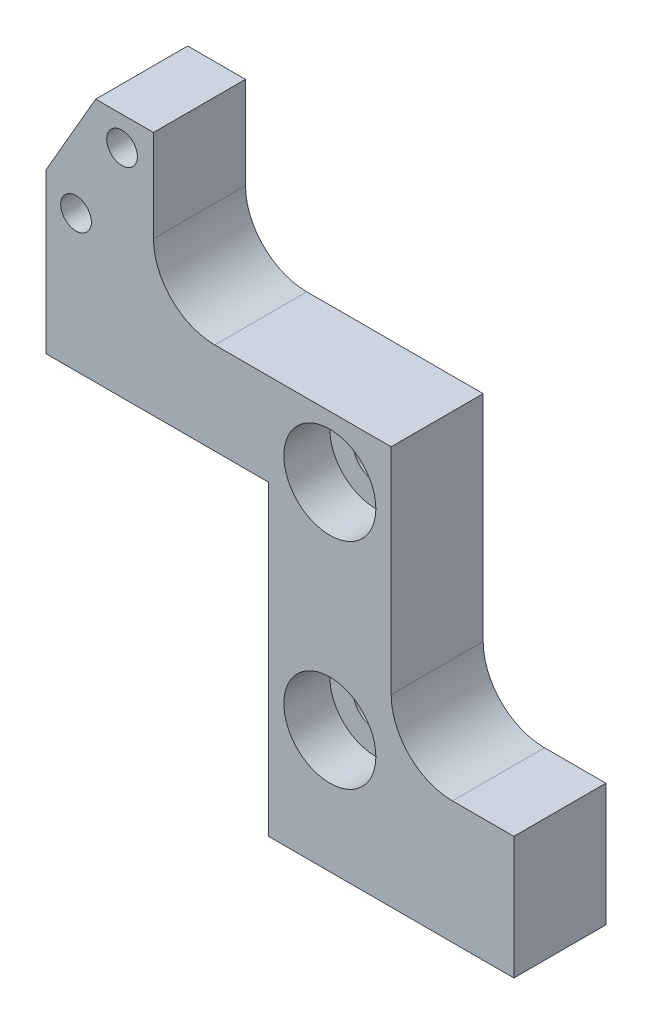
ISO-10303-21;
HEADER;
FILE_DESCRIPTION(('STEP AP214'),'2;1');
FILE_NAME('part.step','',(''),(''),'','','');
FILE_SCHEMA(('AUTOMOTIVE_DESIGN { 1 0 10303 214 1 1 1 1 }'));
ENDSEC;
DATA;
#1=APPLICATION_CONTEXT('core data for automotive mechanical design processes');
#2=APPLICATION_PROTOCOL_DEFINITION('international standard','automotive_design',2000,#1);
#3=PRODUCT_CONTEXT('',#1,'mechanical');
#4=PRODUCT('Part','Part','',(#3));
#5=PRODUCT_RELATED_PRODUCT_CATEGORY('part','',(#4));
#6=PRODUCT_DEFINITION_FORMATION('','',#4);
#7=PRODUCT_DEFINITION_CONTEXT('part definition',#1,'design');
#8=PRODUCT_DEFINITION('design','',#6,#7);
#9=PRODUCT_DEFINITION_SHAPE('','',#8);
#10=(LENGTH_UNIT() NAMED_UNIT(*) SI_UNIT(.MILLI.,.METRE.));
#11=(NAMED_UNIT(*) PLANE_ANGLE_UNIT() SI_UNIT($,.RADIAN.));
#12=(NAMED_UNIT(*) SI_UNIT($,.STERADIAN.) SOLID_ANGLE_UNIT());
#13=UNCERTAINTY_MEASURE_WITH_UNIT(LENGTH_MEASURE(1.E-05),#10,'distance_accuracy_value','');
#14=(GEOMETRIC_REPRESENTATION_CONTEXT(3) GLOBAL_UNCERTAINTY_ASSIGNED_CONTEXT((#13)) GLOBAL_UNIT_ASSIGNED_CONTEXT((#10,
#11,#12)) REPRESENTATION_CONTEXT('',''));
#15=CARTESIAN_POINT('',(0.,0.,0.));
#16=DIRECTION('',(0.,0.,1.));
#17=DIRECTION('',(1.,0.,0.));
#18=AXIS2_PLACEMENT_3D('',#15,#16,#17);
#19=CARTESIAN_POINT('',(0.,0.,6.));
#20=DIRECTION('',(0.,0.,1.));
#21=DIRECTION('',(1.,0.,0.));
#22=AXIS2_PLACEMENT_3D('',#19,#20,#21);
#23=PLANE('',#22);
#24=CARTESIAN_POINT('',(-12.,8.,6.));
#25=DIRECTION('',(0.,0.,1.));
#26=DIRECTION('',(1.,0.,0.));
#27=AXIS2_PLACEMENT_3D('',#24,#25,#26);
#28=CIRCLE('',#27,3.);
#29=CARTESIAN_POINT('',(-9.,8.,6.));
#30=VERTEX_POINT('',#29);
#31=EDGE_CURVE('E180',#30,#30,#28,.T.);
#32=ORIENTED_EDGE('',*,*,#31,.F.);
#33=EDGE_LOOP('',(#32));
#34=FACE_BOUND('',#33,.T.);
#35=CARTESIAN_POINT('',(-12.,22.,6.));
#36=DIRECTION('',(0.,0.,1.));
#37=DIRECTION('',(1.,0.,0.));
#38=AXIS2_PLACEMENT_3D('',#35,#36,#37);
#39=CIRCLE('',#38,3.);
#40=CARTESIAN_POINT('',(-9.,22.,6.));
#41=VERTEX_POINT('',#40);
#42=EDGE_CURVE('E186',#41,#41,#39,.T.);
#43=ORIENTED_EDGE('',*,*,#42,.F.);
#44=EDGE_LOOP('',(#43));
#45=FACE_BOUND('',#44,.T.);
#46=CARTESIAN_POINT('',(-28.55,28.91,6.));
#47=DIRECTION('',(0.,0.,1.));
#48=DIRECTION('',(1.,0.,0.));
#49=AXIS2_PLACEMENT_3D('',#46,#47,#48);
#50=CIRCLE('',#49,1.);
#51=CARTESIAN_POINT('',(-27.55,28.91,6.));
#52=VERTEX_POINT('',#51);
#53=EDGE_CURVE('E201',#52,#52,#50,.T.);
#54=ORIENTED_EDGE('',*,*,#53,.F.);
#55=EDGE_LOOP('',(#54));
#56=FACE_BOUND('',#55,.T.);
#57=DIRECTION('',(0.,1.,0.));
#58=VECTOR('',#57,1.);
#59=CARTESIAN_POINT('',(0.,0.,6.));
#60=LINE('',#59,#58);
#61=CARTESIAN_POINT('',(0.,0.,6.));
#62=VERTEX_POINT('',#61);
#63=CARTESIAN_POINT('',(0.,8.,6.));
#64=VERTEX_POINT('',#63);
#65=EDGE_CURVE('E207',#62,#64,#60,.T.);
#66=ORIENTED_EDGE('',*,*,#65,.T.);
#67=DIRECTION('',(-1.,0.,0.));
#68=VECTOR('',#67,1.);
#69=CARTESIAN_POINT('',(0.,8.,6.));
#70=LINE('',#69,#68);
#71=CARTESIAN_POINT('',(-4.,8.,6.));
#72=VERTEX_POINT('',#71);
#73=EDGE_CURVE('E210',#64,#72,#70,.T.);
#74=ORIENTED_EDGE('',*,*,#73,.T.);
#75=CARTESIAN_POINT('',(-4.,12.,6.));
#76=DIRECTION('',(0.,0.,1.));
#77=DIRECTION('',(1.,0.,0.));
#78=AXIS2_PLACEMENT_3D('',#75,#76,#77);
#79=CIRCLE('',#78,4.);
#80=CARTESIAN_POINT('',(-8.,12.,6.));
#81=VERTEX_POINT('',#80);
#82=EDGE_CURVE('E11',#72,#81,#79,.F.);
#83=ORIENTED_EDGE('',*,*,#82,.T.);
#84=DIRECTION('',(0.,1.,0.));
#85=VECTOR('',#84,1.);
#86=CARTESIAN_POINT('',(-8.,8.,6.));
#87=LINE('',#86,#85);
#88=CARTESIAN_POINT('',(-8.,26.,6.));
#89=VERTEX_POINT('',#88);
#90=EDGE_CURVE('E213',#81,#89,#87,.T.);
#91=ORIENTED_EDGE('',*,*,#90,.T.);
#92=DIRECTION('',(-1.,0.,0.));
#93=VECTOR('',#92,1.);
#94=CARTESIAN_POINT('',(-16.,26.,6.));
#95=LINE('',#94,#93);
#96=CARTESIAN_POINT('',(-19.5,26.,6.));
#97=VERTEX_POINT('',#96);
#98=EDGE_CURVE('E215',#89,#97,#95,.T.);
#99=ORIENTED_EDGE('',*,*,#98,.T.);
#100=CARTESIAN_POINT('',(-19.5,30.,6.));
#101=DIRECTION('',(0.,0.,1.));
#102=DIRECTION('',(1.,0.,0.));
#103=AXIS2_PLACEMENT_3D('',#100,#101,#102);
#104=CIRCLE('',#103,4.);
#105=CARTESIAN_POINT('',(-23.5,30.,6.));
#106=VERTEX_POINT('',#105);
#107=EDGE_CURVE('E290',#97,#106,#104,.F.);
#108=ORIENTED_EDGE('',*,*,#107,.T.);
#109=DIRECTION('',(0.,1.,0.));
#110=VECTOR('',#109,1.);
#111=CARTESIAN_POINT('',(-23.5,26.,6.));
#112=LINE('',#111,#110);
#113=CARTESIAN_POINT('',(-23.5,36.,6.));
#114=VERTEX_POINT('',#113);
#115=EDGE_CURVE('E218',#106,#114,#112,.T.);
#116=ORIENTED_EDGE('',*,*,#115,.T.);
#117=DIRECTION('',(-1.,0.,0.));
#118=VECTOR('',#117,1.);
#119=CARTESIAN_POINT('',(-27.2668384925381,36.,6.));
#120=LINE('',#119,#118);
#121=CARTESIAN_POINT('',(-27.2668384925381,36.,6.));
#122=VERTEX_POINT('',#121);
#123=EDGE_CURVE('E220',#114,#122,#120,.T.);
#124=ORIENTED_EDGE('',*,*,#123,.T.);
#125=DIRECTION('',(-0.499999999999995,-0.866025403784442,0.));
#126=VECTOR('',#125,1.);
#127=CARTESIAN_POINT('',(-27.2668384925381,36.,6.));
#128=LINE('',#127,#126);
#129=CARTESIAN_POINT('',(-30.5,30.4,6.));
#130=VERTEX_POINT('',#129);
#131=EDGE_CURVE('E222',#122,#130,#128,.T.);
#132=ORIENTED_EDGE('',*,*,#131,.T.);
#133=DIRECTION('',(0.,-1.,0.));
#134=VECTOR('',#133,1.);
#135=CARTESIAN_POINT('',(-30.5,26.,6.));
#136=LINE('',#135,#134);
#137=CARTESIAN_POINT('',(-30.5,20.,6.));
#138=VERTEX_POINT('',#137);
#139=EDGE_CURVE('E224',#130,#138,#136,.T.);
#140=ORIENTED_EDGE('',*,*,#139,.T.);
#141=DIRECTION('',(1.,0.,0.));
#142=VECTOR('',#141,1.);
#143=CARTESIAN_POINT('',(-16.,20.,6.));
#144=LINE('',#143,#142);
#145=CARTESIAN_POINT('',(-16.,20.,6.));
#146=VERTEX_POINT('',#145);
#147=EDGE_CURVE('E226',#138,#146,#144,.T.);
#148=ORIENTED_EDGE('',*,*,#147,.T.);
#149=DIRECTION('',(0.,-1.,0.));
#150=VECTOR('',#149,1.);
#151=CARTESIAN_POINT('',(-16.,8.,6.));
#152=LINE('',#151,#150);
#153=CARTESIAN_POINT('',(-16.,0.,6.));
#154=VERTEX_POINT('',#153);
#155=EDGE_CURVE('E228',#146,#154,#152,.T.);
#156=ORIENTED_EDGE('',*,*,#155,.T.);
#157=DIRECTION('',(1.,0.,0.));
#158=VECTOR('',#157,1.);
#159=CARTESIAN_POINT('',(0.,0.,6.));
#160=LINE('',#159,#158);
#161=EDGE_CURVE('E230',#154,#62,#160,.T.);
#162=ORIENTED_EDGE('',*,*,#161,.T.);
#163=EDGE_LOOP('',(#66,#74,#83,#91,#99,#108,#116,#124,#132,#140,#148,#156,#162));
#164=FACE_BOUND('',#163,.T.);
#165=CARTESIAN_POINT('',(-25.55,34.1061524227066,6.));
#166=DIRECTION('',(0.,0.,1.));
#167=DIRECTION('',(1.,0.,0.));
#168=AXIS2_PLACEMENT_3D('',#165,#166,#167);
#169=CIRCLE('',#168,1.);
#170=CARTESIAN_POINT('',(-24.55,34.1061524227066,6.));
#171=VERTEX_POINT('',#170);
#172=EDGE_CURVE('E195',#171,#171,#169,.T.);
#173=ORIENTED_EDGE('',*,*,#172,.F.);
#174=EDGE_LOOP('',(#173));
#175=FACE_BOUND('',#174,.T.);
#176=ADVANCED_FACE('F37',(#34,#45,#56,#164,#175),#23,.T.);
#177=CARTESIAN_POINT('',(0.,0.,0.));
#178=DIRECTION('',(0.,0.,1.));
#179=DIRECTION('',(1.,0.,0.));
#180=AXIS2_PLACEMENT_3D('',#177,#178,#179);
#181=PLANE('',#180);
#182=CARTESIAN_POINT('',(-12.,8.,0.));
#183=DIRECTION('',(0.,0.,1.));
#184=DIRECTION('',(1.,0.,0.));
#185=AXIS2_PLACEMENT_3D('',#182,#183,#184);
#186=CIRCLE('',#185,1.5);
#187=CARTESIAN_POINT('',(-10.5,8.,0.));
#188=VERTEX_POINT('',#187);
#189=EDGE_CURVE('E171',#188,#188,#186,.T.);
#190=ORIENTED_EDGE('',*,*,#189,.T.);
#191=EDGE_LOOP('',(#190));
#192=FACE_BOUND('',#191,.T.);
#193=CARTESIAN_POINT('',(-12.,22.,0.));
#194=DIRECTION('',(0.,0.,1.));
#195=DIRECTION('',(1.,0.,0.));
#196=AXIS2_PLACEMENT_3D('',#193,#194,#195);
#197=CIRCLE('',#196,1.5);
#198=CARTESIAN_POINT('',(-10.5,22.,0.));
#199=VERTEX_POINT('',#198);
#200=EDGE_CURVE('E177',#199,#199,#197,.T.);
#201=ORIENTED_EDGE('',*,*,#200,.T.);
#202=EDGE_LOOP('',(#201));
#203=FACE_BOUND('',#202,.T.);
#204=CARTESIAN_POINT('',(-28.55,28.91,0.));
#205=DIRECTION('',(0.,0.,1.));
#206=DIRECTION('',(1.,0.,0.));
#207=AXIS2_PLACEMENT_3D('',#204,#205,#206);
#208=CIRCLE('',#207,1.);
#209=CARTESIAN_POINT('',(-27.55,28.91,0.));
#210=VERTEX_POINT('',#209);
#211=EDGE_CURVE('E198',#210,#210,#208,.T.);
#212=ORIENTED_EDGE('',*,*,#211,.T.);
#213=EDGE_LOOP('',(#212));
#214=FACE_BOUND('',#213,.T.);
#215=DIRECTION('',(0.,1.,0.));
#216=VECTOR('',#215,1.);
#217=CARTESIAN_POINT('',(0.,0.,0.));
#218=LINE('',#217,#216);
#219=CARTESIAN_POINT('',(0.,0.,0.));
#220=VERTEX_POINT('',#219);
#221=CARTESIAN_POINT('',(0.,8.,0.));
#222=VERTEX_POINT('',#221);
#223=EDGE_CURVE('E204',#220,#222,#218,.T.);
#224=ORIENTED_EDGE('',*,*,#223,.F.);
#225=DIRECTION('',(1.,0.,0.));
#226=VECTOR('',#225,1.);
#227=CARTESIAN_POINT('',(0.,0.,0.));
#228=LINE('',#227,#226);
#229=CARTESIAN_POINT('',(-16.,0.,0.));
#230=VERTEX_POINT('',#229);
#231=EDGE_CURVE('E211',#230,#220,#228,.T.);
#232=ORIENTED_EDGE('',*,*,#231,.F.);
#233=DIRECTION('',(0.,-1.,0.));
#234=VECTOR('',#233,1.);
#235=CARTESIAN_POINT('',(-16.,0.,0.));
#236=LINE('',#235,#234);
#237=CARTESIAN_POINT('',(-16.,20.,0.));
#238=VERTEX_POINT('',#237);
#239=EDGE_CURVE('E254',#238,#230,#236,.T.);
#240=ORIENTED_EDGE('',*,*,#239,.F.);
#241=DIRECTION('',(1.,0.,0.));
#242=VECTOR('',#241,1.);
#243=CARTESIAN_POINT('',(-16.,20.,0.));
#244=LINE('',#243,#242);
#245=CARTESIAN_POINT('',(-30.5,20.,0.));
#246=VERTEX_POINT('',#245);
#247=EDGE_CURVE('E251',#246,#238,#244,.T.);
#248=ORIENTED_EDGE('',*,*,#247,.F.);
#249=DIRECTION('',(0.,-1.,0.));
#250=VECTOR('',#249,1.);
#251=CARTESIAN_POINT('',(-30.5,26.,0.));
#252=LINE('',#251,#250);
#253=CARTESIAN_POINT('',(-30.5,30.4,0.));
#254=VERTEX_POINT('',#253);
#255=EDGE_CURVE('E249',#254,#246,#252,.T.);
#256=ORIENTED_EDGE('',*,*,#255,.F.);
#257=DIRECTION('',(-0.499999999999995,-0.866025403784442,0.));
#258=VECTOR('',#257,1.);
#259=CARTESIAN_POINT('',(-27.2668384925381,36.,0.));
#260=LINE('',#259,#258);
#261=CARTESIAN_POINT('',(-27.2668384925381,36.,0.));
#262=VERTEX_POINT('',#261);
#263=EDGE_CURVE('E246',#262,#254,#260,.T.);
#264=ORIENTED_EDGE('',*,*,#263,.F.);
#265=DIRECTION('',(-1.,0.,0.));
#266=VECTOR('',#265,1.);
#267=CARTESIAN_POINT('',(-27.2668384925381,36.,0.));
#268=LINE('',#267,#266);
#269=CARTESIAN_POINT('',(-23.5,36.,0.));
#270=VERTEX_POINT('',#269);
#271=EDGE_CURVE('E244',#270,#262,#268,.T.);
#272=ORIENTED_EDGE('',*,*,#271,.F.);
#273=DIRECTION('',(0.,1.,0.));
#274=VECTOR('',#273,1.);
#275=CARTESIAN_POINT('',(-23.5,26.,0.));
#276=LINE('',#275,#274);
#277=CARTESIAN_POINT('',(-23.5,30.,0.));
#278=VERTEX_POINT('',#277);
#279=EDGE_CURVE('E242',#278,#270,#276,.T.);
#280=ORIENTED_EDGE('',*,*,#279,.F.);
#281=CARTESIAN_POINT('',(-19.5,30.,0.));
#282=DIRECTION('',(0.,0.,1.));
#283=DIRECTION('',(1.,0.,0.));
#284=AXIS2_PLACEMENT_3D('',#281,#282,#283);
#285=CIRCLE('',#284,4.);
#286=CARTESIAN_POINT('',(-19.5,26.,0.));
#287=VERTEX_POINT('',#286);
#288=EDGE_CURVE('E288',#278,#287,#285,.T.);
#289=ORIENTED_EDGE('',*,*,#288,.T.);
#290=DIRECTION('',(-1.,0.,0.));
#291=VECTOR('',#290,1.);
#292=CARTESIAN_POINT('',(-16.,26.,0.));
#293=LINE('',#292,#291);
#294=CARTESIAN_POINT('',(-8.,26.,0.));
#295=VERTEX_POINT('',#294);
#296=EDGE_CURVE('E239',#295,#287,#293,.T.);
#297=ORIENTED_EDGE('',*,*,#296,.F.);
#298=DIRECTION('',(0.,1.,0.));
#299=VECTOR('',#298,1.);
#300=CARTESIAN_POINT('',(-8.,8.,0.));
#301=LINE('',#300,#299);
#302=CARTESIAN_POINT('',(-8.,12.,0.));
#303=VERTEX_POINT('',#302);
#304=EDGE_CURVE('E237',#303,#295,#301,.T.);
#305=ORIENTED_EDGE('',*,*,#304,.F.);
#306=CARTESIAN_POINT('',(-4.,12.,0.));
#307=DIRECTION('',(0.,0.,1.));
#308=DIRECTION('',(1.,0.,0.));
#309=AXIS2_PLACEMENT_3D('',#306,#307,#308);
#310=CIRCLE('',#309,4.);
#311=CARTESIAN_POINT('',(-4.,8.,0.));
#312=VERTEX_POINT('',#311);
#313=EDGE_CURVE('E45',#303,#312,#310,.T.);
#314=ORIENTED_EDGE('',*,*,#313,.T.);
#315=DIRECTION('',(-1.,0.,0.));
#316=VECTOR('',#315,1.);
#317=CARTESIAN_POINT('',(0.,8.,0.));
#318=LINE('',#317,#316);
#319=EDGE_CURVE('E235',#222,#312,#318,.T.);
#320=ORIENTED_EDGE('',*,*,#319,.F.);
#321=EDGE_LOOP('',(#224,#232,#240,#248,#256,#264,#272,#280,#289,#297,#305,#314,#320));
#322=FACE_BOUND('',#321,.T.);
#323=CARTESIAN_POINT('',(-25.55,34.1061524227066,0.));
#324=DIRECTION('',(0.,0.,1.));
#325=DIRECTION('',(1.,0.,0.));
#326=AXIS2_PLACEMENT_3D('',#323,#324,#325);
#327=CIRCLE('',#326,1.);
#328=CARTESIAN_POINT('',(-24.55,34.1061524227066,0.));
#329=VERTEX_POINT('',#328);
#330=EDGE_CURVE('E192',#329,#329,#327,.T.);
#331=ORIENTED_EDGE('',*,*,#330,.T.);
#332=EDGE_LOOP('',(#331));
#333=FACE_BOUND('',#332,.T.);
#334=ADVANCED_FACE('F304',(#192,#203,#214,#322,#333),#181,.F.);
#335=CARTESIAN_POINT('',(0.,0.,6.));
#336=DIRECTION('',(-1.,0.,0.));
#337=DIRECTION('',(0.,-1.,0.));
#338=AXIS2_PLACEMENT_3D('',#335,#336,#337);
#339=PLANE('',#338);
#340=ORIENTED_EDGE('',*,*,#223,.T.);
#341=DIRECTION('',(0.,0.,-1.));
#342=VECTOR('',#341,1.);
#343=CARTESIAN_POINT('',(0.,8.,6.));
#344=LINE('',#343,#342);
#345=EDGE_CURVE('E280',#64,#222,#344,.T.);
#346=ORIENTED_EDGE('',*,*,#345,.F.);
#347=ORIENTED_EDGE('',*,*,#65,.F.);
#348=DIRECTION('',(0.,0.,-1.));
#349=VECTOR('',#348,1.);
#350=CARTESIAN_POINT('',(0.,0.,6.));
#351=LINE('',#350,#349);
#352=EDGE_CURVE('E232',#62,#220,#351,.T.);
#353=ORIENTED_EDGE('',*,*,#352,.T.);
#354=EDGE_LOOP('',(#340,#346,#347,#353));
#355=FACE_BOUND('',#354,.T.);
#356=ADVANCED_FACE('F352',(#355),#339,.F.);
#357=CARTESIAN_POINT('',(0.,8.,6.));
#358=DIRECTION('',(0.,-1.,0.));
#359=DIRECTION('',(1.,0.,0.));
#360=AXIS2_PLACEMENT_3D('',#357,#358,#359);
#361=PLANE('',#360);
#362=ORIENTED_EDGE('',*,*,#319,.T.);
#363=DIRECTION('',(0.,0.,-1.));
#364=VECTOR('',#363,1.);
#365=CARTESIAN_POINT('',(-4.,8.,6.));
#366=LINE('',#365,#364);
#367=EDGE_CURVE('E52',#312,#72,#366,.F.);
#368=ORIENTED_EDGE('',*,*,#367,.T.);
#369=ORIENTED_EDGE('',*,*,#73,.F.);
#370=ORIENTED_EDGE('',*,*,#345,.T.);
#371=EDGE_LOOP('',(#362,#368,#369,#370));
#372=FACE_BOUND('',#371,.T.);
#373=ADVANCED_FACE('F353',(#372),#361,.F.);
#374=CARTESIAN_POINT('',(-8.,8.,6.));
#375=DIRECTION('',(-1.,0.,0.));
#376=DIRECTION('',(0.,0.,1.));
#377=AXIS2_PLACEMENT_3D('',#374,#375,#376);
#378=PLANE('',#377);
#379=ORIENTED_EDGE('',*,*,#90,.F.);
#380=DIRECTION('',(0.,0.,-1.));
#381=VECTOR('',#380,1.);
#382=CARTESIAN_POINT('',(-8.,12.,0.));
#383=LINE('',#382,#381);
#384=EDGE_CURVE('E292',#81,#303,#383,.T.);
#385=ORIENTED_EDGE('',*,*,#384,.T.);
#386=ORIENTED_EDGE('',*,*,#304,.T.);
#387=DIRECTION('',(0.,0.,-1.));
#388=VECTOR('',#387,1.);
#389=CARTESIAN_POINT('',(-8.,26.,6.));
#390=LINE('',#389,#388);
#391=EDGE_CURVE('E277',#89,#295,#390,.T.);
#392=ORIENTED_EDGE('',*,*,#391,.F.);
#393=EDGE_LOOP('',(#379,#385,#386,#392));
#394=FACE_BOUND('',#393,.T.);
#395=ADVANCED_FACE('F298',(#394),#378,.F.);
#396=CARTESIAN_POINT('',(-16.,26.,6.));
#397=DIRECTION('',(0.,-1.,0.));
#398=DIRECTION('',(1.,0.,0.));
#399=AXIS2_PLACEMENT_3D('',#396,#397,#398);
#400=PLANE('',#399);
#401=ORIENTED_EDGE('',*,*,#296,.T.);
#402=DIRECTION('',(0.,0.,-1.));
#403=VECTOR('',#402,1.);
#404=CARTESIAN_POINT('',(-19.5,26.,6.));
#405=LINE('',#404,#403);
#406=EDGE_CURVE('E286',#287,#97,#405,.F.);
#407=ORIENTED_EDGE('',*,*,#406,.T.);
#408=ORIENTED_EDGE('',*,*,#98,.F.);
#409=ORIENTED_EDGE('',*,*,#391,.T.);
#410=EDGE_LOOP('',(#401,#407,#408,#409));
#411=FACE_BOUND('',#410,.T.);
#412=ADVANCED_FACE('F310',(#411),#400,.F.);
#413=CARTESIAN_POINT('',(-23.5,26.,6.));
#414=DIRECTION('',(-1.,0.,0.));
#415=DIRECTION('',(0.,0.,1.));
#416=AXIS2_PLACEMENT_3D('',#413,#414,#415);
#417=PLANE('',#416);
#418=ORIENTED_EDGE('',*,*,#115,.F.);
#419=DIRECTION('',(0.,0.,-1.));
#420=VECTOR('',#419,1.);
#421=CARTESIAN_POINT('',(-23.5,30.,0.));
#422=LINE('',#421,#420);
#423=EDGE_CURVE('E283',#106,#278,#422,.T.);
#424=ORIENTED_EDGE('',*,*,#423,.T.);
#425=ORIENTED_EDGE('',*,*,#279,.T.);
#426=DIRECTION('',(0.,0.,-1.));
#427=VECTOR('',#426,1.);
#428=CARTESIAN_POINT('',(-23.5,36.,6.));
#429=LINE('',#428,#427);
#430=EDGE_CURVE('E274',#114,#270,#429,.T.);
#431=ORIENTED_EDGE('',*,*,#430,.F.);
#432=EDGE_LOOP('',(#418,#424,#425,#431));
#433=FACE_BOUND('',#432,.T.);
#434=ADVANCED_FACE('F319',(#433),#417,.F.);
#435=CARTESIAN_POINT('',(-27.2668384925381,36.,6.));
#436=DIRECTION('',(0.,-1.,0.));
#437=DIRECTION('',(0.,0.,-1.));
#438=AXIS2_PLACEMENT_3D('',#435,#436,#437);
#439=PLANE('',#438);
#440=ORIENTED_EDGE('',*,*,#271,.T.);
#441=DIRECTION('',(0.,0.,-1.));
#442=VECTOR('',#441,1.);
#443=CARTESIAN_POINT('',(-27.2668384925381,36.,6.));
#444=LINE('',#443,#442);
#445=EDGE_CURVE('E271',#122,#262,#444,.T.);
#446=ORIENTED_EDGE('',*,*,#445,.F.);
#447=ORIENTED_EDGE('',*,*,#123,.F.);
#448=ORIENTED_EDGE('',*,*,#430,.T.);
#449=EDGE_LOOP('',(#440,#446,#447,#448));
#450=FACE_BOUND('',#449,.T.);
#451=ADVANCED_FACE('F325',(#450),#439,.F.);
#452=CARTESIAN_POINT('',(-27.2668384925381,36.,6.));
#453=DIRECTION('',(0.866025403784442,-0.499999999999995,0.));
#454=DIRECTION('',(0.499999999999995,0.866025403784442,0.));
#455=AXIS2_PLACEMENT_3D('',#452,#453,#454);
#456=PLANE('',#455);
#457=ORIENTED_EDGE('',*,*,#263,.T.);
#458=DIRECTION('',(0.,0.,-1.));
#459=VECTOR('',#458,1.);
#460=CARTESIAN_POINT('',(-30.5,30.4,6.));
#461=LINE('',#460,#459);
#462=EDGE_CURVE('E268',#130,#254,#461,.T.);
#463=ORIENTED_EDGE('',*,*,#462,.F.);
#464=ORIENTED_EDGE('',*,*,#131,.F.);
#465=ORIENTED_EDGE('',*,*,#445,.T.);
#466=EDGE_LOOP('',(#457,#463,#464,#465));
#467=FACE_BOUND('',#466,.T.);
#468=ADVANCED_FACE('F329',(#467),#456,.F.);
#469=CARTESIAN_POINT('',(-30.5,26.,6.));
#470=DIRECTION('',(1.,0.,0.));
#471=DIRECTION('',(0.,0.,-1.));
#472=AXIS2_PLACEMENT_3D('',#469,#470,#471);
#473=PLANE('',#472);
#474=ORIENTED_EDGE('',*,*,#255,.T.);
#475=DIRECTION('',(0.,0.,-1.));
#476=VECTOR('',#475,1.);
#477=CARTESIAN_POINT('',(-30.5,20.,6.));
#478=LINE('',#477,#476);
#479=EDGE_CURVE('E265',#138,#246,#478,.T.);
#480=ORIENTED_EDGE('',*,*,#479,.F.);
#481=ORIENTED_EDGE('',*,*,#139,.F.);
#482=ORIENTED_EDGE('',*,*,#462,.T.);
#483=EDGE_LOOP('',(#474,#480,#481,#482));
#484=FACE_BOUND('',#483,.T.);
#485=ADVANCED_FACE('F336',(#484),#473,.F.);
#486=CARTESIAN_POINT('',(-16.,20.,6.));
#487=DIRECTION('',(0.,1.,0.));
#488=DIRECTION('',(-1.,0.,0.));
#489=AXIS2_PLACEMENT_3D('',#486,#487,#488);
#490=PLANE('',#489);
#491=ORIENTED_EDGE('',*,*,#247,.T.);
#492=DIRECTION('',(0.,0.,-1.));
#493=VECTOR('',#492,1.);
#494=CARTESIAN_POINT('',(-16.,20.,6.));
#495=LINE('',#494,#493);
#496=EDGE_CURVE('E262',#146,#238,#495,.T.);
#497=ORIENTED_EDGE('',*,*,#496,.F.);
#498=ORIENTED_EDGE('',*,*,#147,.F.);
#499=ORIENTED_EDGE('',*,*,#479,.T.);
#500=EDGE_LOOP('',(#491,#497,#498,#499));
#501=FACE_BOUND('',#500,.T.);
#502=ADVANCED_FACE('F339',(#501),#490,.F.);
#503=CARTESIAN_POINT('',(-16.,0.,6.));
#504=DIRECTION('',(1.,0.,0.));
#505=DIRECTION('',(0.,0.,-1.));
#506=AXIS2_PLACEMENT_3D('',#503,#504,#505);
#507=PLANE('',#506);
#508=ORIENTED_EDGE('',*,*,#239,.T.);
#509=DIRECTION('',(0.,0.,-1.));
#510=VECTOR('',#509,1.);
#511=CARTESIAN_POINT('',(-16.,0.,6.));
#512=LINE('',#511,#510);
#513=EDGE_CURVE('E259',#154,#230,#512,.T.);
#514=ORIENTED_EDGE('',*,*,#513,.F.);
#515=ORIENTED_EDGE('',*,*,#155,.F.);
#516=ORIENTED_EDGE('',*,*,#496,.T.);
#517=EDGE_LOOP('',(#508,#514,#515,#516));
#518=FACE_BOUND('',#517,.T.);
#519=ADVANCED_FACE('F343',(#518),#507,.F.);
#520=CARTESIAN_POINT('',(0.,0.,6.));
#521=DIRECTION('',(0.,1.,0.));
#522=DIRECTION('',(-1.,0.,0.));
#523=AXIS2_PLACEMENT_3D('',#520,#521,#522);
#524=PLANE('',#523);
#525=CARTESIAN_POINT('',(-8.,0.,3.));
#526=DIRECTION('',(0.,-1.,0.));
#527=DIRECTION('',(0.,0.,-1.));
#528=AXIS2_PLACEMENT_3D('',#525,#526,#527);
#529=CIRCLE('',#528,0.999999999999989);
#530=CARTESIAN_POINT('',(-8.,0.,2.00000000000001));
#531=VERTEX_POINT('',#530);
#532=EDGE_CURVE('E148',#531,#531,#529,.T.);
#533=ORIENTED_EDGE('',*,*,#532,.F.);
#534=EDGE_LOOP('',(#533));
#535=FACE_BOUND('',#534,.T.);
#536=CARTESIAN_POINT('',(-13.,0.,3.));
#537=DIRECTION('',(0.,-1.,0.));
#538=DIRECTION('',(0.,0.,-1.));
#539=AXIS2_PLACEMENT_3D('',#536,#537,#538);
#540=CIRCLE('',#539,1.525);
#541=CARTESIAN_POINT('',(-13.,0.,1.475));
#542=VERTEX_POINT('',#541);
#543=EDGE_CURVE('E147',#542,#542,#540,.T.);
#544=ORIENTED_EDGE('',*,*,#543,.F.);
#545=EDGE_LOOP('',(#544));
#546=FACE_BOUND('',#545,.T.);
#547=CARTESIAN_POINT('',(-3.,0.,3.));
#548=DIRECTION('',(0.,-1.,0.));
#549=DIRECTION('',(0.,0.,-1.));
#550=AXIS2_PLACEMENT_3D('',#547,#548,#549);
#551=CIRCLE('',#550,1.525);
#552=CARTESIAN_POINT('',(-3.,0.,1.475));
#553=VERTEX_POINT('',#552);
#554=EDGE_CURVE('E161',#553,#553,#551,.T.);
#555=ORIENTED_EDGE('',*,*,#554,.F.);
#556=EDGE_LOOP('',(#555));
#557=FACE_BOUND('',#556,.T.);
#558=ORIENTED_EDGE('',*,*,#231,.T.);
#559=ORIENTED_EDGE('',*,*,#352,.F.);
#560=ORIENTED_EDGE('',*,*,#161,.F.);
#561=ORIENTED_EDGE('',*,*,#513,.T.);
#562=EDGE_LOOP('',(#558,#559,#560,#561));
#563=FACE_BOUND('',#562,.T.);
#564=ADVANCED_FACE('F349',(#535,#546,#557,#563),#524,.F.);
#565=CARTESIAN_POINT('',(-28.55,28.91,6.));
#566=DIRECTION('',(0.,0.,-1.));
#567=DIRECTION('',(-1.,0.,0.));
#568=AXIS2_PLACEMENT_3D('',#565,#566,#567);
#569=CYLINDRICAL_SURFACE('',#568,1.);
#570=ORIENTED_EDGE('',*,*,#53,.T.);
#571=EDGE_LOOP('',(#570));
#572=FACE_BOUND('',#571,.T.);
#573=ORIENTED_EDGE('',*,*,#211,.F.);
#574=EDGE_LOOP('',(#573));
#575=FACE_BOUND('',#574,.T.);
#576=ADVANCED_FACE('F375',(#572,#575),#569,.F.);
#577=CARTESIAN_POINT('',(-25.55,34.1061524227066,6.));
#578=DIRECTION('',(0.,0.,-1.));
#579=DIRECTION('',(-1.,0.,0.));
#580=AXIS2_PLACEMENT_3D('',#577,#578,#579);
#581=CYLINDRICAL_SURFACE('',#580,1.);
#582=ORIENTED_EDGE('',*,*,#172,.T.);
#583=EDGE_LOOP('',(#582));
#584=FACE_BOUND('',#583,.T.);
#585=ORIENTED_EDGE('',*,*,#330,.F.);
#586=EDGE_LOOP('',(#585));
#587=FACE_BOUND('',#586,.T.);
#588=ADVANCED_FACE('F363',(#584,#587),#581,.F.);
#589=CARTESIAN_POINT('',(-19.5,30.,6.));
#590=DIRECTION('',(0.,0.,1.));
#591=DIRECTION('',(1.,0.,0.));
#592=AXIS2_PLACEMENT_3D('',#589,#590,#591);
#593=CYLINDRICAL_SURFACE('',#592,4.);
#594=ORIENTED_EDGE('',*,*,#107,.F.);
#595=ORIENTED_EDGE('',*,*,#406,.F.);
#596=ORIENTED_EDGE('',*,*,#288,.F.);
#597=ORIENTED_EDGE('',*,*,#423,.F.);
#598=EDGE_LOOP('',(#594,#595,#596,#597));
#599=FACE_BOUND('',#598,.T.);
#600=ADVANCED_FACE('F317',(#599),#593,.F.);
#601=CARTESIAN_POINT('',(-4.,12.,6.));
#602=DIRECTION('',(0.,0.,1.));
#603=DIRECTION('',(1.,0.,0.));
#604=AXIS2_PLACEMENT_3D('',#601,#602,#603);
#605=CYLINDRICAL_SURFACE('',#604,4.);
#606=ORIENTED_EDGE('',*,*,#82,.F.);
#607=ORIENTED_EDGE('',*,*,#367,.F.);
#608=ORIENTED_EDGE('',*,*,#313,.F.);
#609=ORIENTED_EDGE('',*,*,#384,.F.);
#610=EDGE_LOOP('',(#606,#607,#608,#609));
#611=FACE_BOUND('',#610,.T.);
#612=ADVANCED_FACE('F39',(#611),#605,.F.);
#613=CARTESIAN_POINT('',(-12.,22.,3.));
#614=DIRECTION('',(0.,0.,1.));
#615=DIRECTION('',(1.,0.,0.));
#616=AXIS2_PLACEMENT_3D('',#613,#614,#615);
#617=CYLINDRICAL_SURFACE('',#616,3.);
#618=CARTESIAN_POINT('',(-12.,22.,3.));
#619=DIRECTION('',(0.,0.,1.));
#620=DIRECTION('',(1.,0.,0.));
#621=AXIS2_PLACEMENT_3D('',#618,#619,#620);
#622=CIRCLE('',#621,3.);
#623=CARTESIAN_POINT('',(-9.,22.,3.));
#624=VERTEX_POINT('',#623);
#625=EDGE_CURVE('E189',#624,#624,#622,.T.);
#626=ORIENTED_EDGE('',*,*,#625,.F.);
#627=EDGE_LOOP('',(#626));
#628=FACE_BOUND('',#627,.T.);
#629=ORIENTED_EDGE('',*,*,#42,.T.);
#630=EDGE_LOOP('',(#629));
#631=FACE_BOUND('',#630,.T.);
#632=ADVANCED_FACE('F355',(#628,#631),#617,.F.);
#633=CARTESIAN_POINT('',(-12.,22.,3.));
#634=DIRECTION('',(0.,0.,1.));
#635=DIRECTION('',(1.,0.,0.));
#636=AXIS2_PLACEMENT_3D('',#633,#634,#635);
#637=PLANE('',#636);
#638=CARTESIAN_POINT('',(-12.,22.,3.));
#639=DIRECTION('',(0.,0.,1.));
#640=DIRECTION('',(1.,0.,0.));
#641=AXIS2_PLACEMENT_3D('',#638,#639,#640);
#642=CIRCLE('',#641,1.5);
#643=CARTESIAN_POINT('',(-10.5,22.,3.));
#644=VERTEX_POINT('',#643);
#645=EDGE_CURVE('E174',#644,#644,#642,.T.);
#646=ORIENTED_EDGE('',*,*,#645,.F.);
#647=EDGE_LOOP('',(#646));
#648=FACE_BOUND('',#647,.T.);
#649=ORIENTED_EDGE('',*,*,#625,.T.);
#650=EDGE_LOOP('',(#649));
#651=FACE_BOUND('',#650,.T.);
#652=ADVANCED_FACE('F360',(#648,#651),#637,.T.);
#653=CARTESIAN_POINT('',(-12.,8.,3.));
#654=DIRECTION('',(0.,0.,1.));
#655=DIRECTION('',(1.,0.,0.));
#656=AXIS2_PLACEMENT_3D('',#653,#654,#655);
#657=CYLINDRICAL_SURFACE('',#656,3.);
#658=CARTESIAN_POINT('',(-12.,8.,3.));
#659=DIRECTION('',(0.,0.,1.));
#660=DIRECTION('',(1.,0.,0.));
#661=AXIS2_PLACEMENT_3D('',#658,#659,#660);
#662=CIRCLE('',#661,3.);
#663=CARTESIAN_POINT('',(-9.,8.,3.));
#664=VERTEX_POINT('',#663);
#665=EDGE_CURVE('E183',#664,#664,#662,.T.);
#666=ORIENTED_EDGE('',*,*,#665,.F.);
#667=EDGE_LOOP('',(#666));
#668=FACE_BOUND('',#667,.T.);
#669=ORIENTED_EDGE('',*,*,#31,.T.);
#670=EDGE_LOOP('',(#669));
#671=FACE_BOUND('',#670,.T.);
#672=ADVANCED_FACE('F484',(#668,#671),#657,.F.);
#673=CARTESIAN_POINT('',(-12.,8.,3.));
#674=DIRECTION('',(0.,0.,1.));
#675=DIRECTION('',(1.,0.,0.));
#676=AXIS2_PLACEMENT_3D('',#673,#674,#675);
#677=PLANE('',#676);
#678=CARTESIAN_POINT('',(-12.,8.,3.));
#679=DIRECTION('',(0.,0.,1.));
#680=DIRECTION('',(1.,0.,0.));
#681=AXIS2_PLACEMENT_3D('',#678,#679,#680);
#682=CIRCLE('',#681,1.5);
#683=CARTESIAN_POINT('',(-10.5,8.,3.));
#684=VERTEX_POINT('',#683);
#685=EDGE_CURVE('E170',#684,#684,#682,.T.);
#686=ORIENTED_EDGE('',*,*,#685,.F.);
#687=EDGE_LOOP('',(#686));
#688=FACE_BOUND('',#687,.T.);
#689=ORIENTED_EDGE('',*,*,#665,.T.);
#690=EDGE_LOOP('',(#689));
#691=FACE_BOUND('',#690,.T.);
#692=ADVANCED_FACE('F493',(#688,#691),#677,.T.);
#693=CARTESIAN_POINT('',(-12.,22.,0.));
#694=DIRECTION('',(0.,0.,1.));
#695=DIRECTION('',(1.,0.,0.));
#696=AXIS2_PLACEMENT_3D('',#693,#694,#695);
#697=CYLINDRICAL_SURFACE('',#696,1.5);
#698=ORIENTED_EDGE('',*,*,#200,.F.);
#699=EDGE_LOOP('',(#698));
#700=FACE_BOUND('',#699,.T.);
#701=ORIENTED_EDGE('',*,*,#645,.T.);
#702=EDGE_LOOP('',(#701));
#703=FACE_BOUND('',#702,.T.);
#704=ADVANCED_FACE('F501',(#700,#703),#697,.F.);
#705=CARTESIAN_POINT('',(-12.,8.,0.));
#706=DIRECTION('',(0.,0.,1.));
#707=DIRECTION('',(1.,0.,0.));
#708=AXIS2_PLACEMENT_3D('',#705,#706,#707);
#709=CYLINDRICAL_SURFACE('',#708,1.5);
#710=ORIENTED_EDGE('',*,*,#189,.F.);
#711=EDGE_LOOP('',(#710));
#712=FACE_BOUND('',#711,.T.);
#713=ORIENTED_EDGE('',*,*,#685,.T.);
#714=EDGE_LOOP('',(#713));
#715=FACE_BOUND('',#714,.T.);
#716=ADVANCED_FACE('F510',(#712,#715),#709,.F.);
#717=CARTESIAN_POINT('',(-3.,4.,3.));
#718=DIRECTION('',(0.,-1.,0.));
#719=DIRECTION('',(0.,0.,-1.));
#720=AXIS2_PLACEMENT_3D('',#717,#718,#719);
#721=CONICAL_SURFACE('',#720,1.25,1.02974425867665);
#722=CARTESIAN_POINT('',(-3.,4.75107577378445,3.));
#723=VERTEX_POINT('',#722);
#724=VERTEX_LOOP('',#723);
#725=FACE_BOUND('',#724,.T.);
#726=CARTESIAN_POINT('',(-3.,4.,3.));
#727=DIRECTION('',(0.,-1.,0.));
#728=DIRECTION('',(0.,0.,-1.));
#729=AXIS2_PLACEMENT_3D('',#726,#727,#728);
#730=CIRCLE('',#729,1.25);
#731=CARTESIAN_POINT('',(-3.,4.,1.75));
#732=VERTEX_POINT('',#731);
#733=EDGE_CURVE('E167',#732,#732,#730,.T.);
#734=ORIENTED_EDGE('',*,*,#733,.T.);
#735=EDGE_LOOP('',(#734));
#736=FACE_BOUND('',#735,.T.);
#737=ADVANCED_FACE('F519',(#725,#736),#721,.F.);
#738=CARTESIAN_POINT('',(-3.,0.,3.));
#739=DIRECTION('',(0.,-1.,0.));
#740=DIRECTION('',(0.,0.,-1.));
#741=AXIS2_PLACEMENT_3D('',#738,#739,#740);
#742=CYLINDRICAL_SURFACE('',#741,1.25);
#743=ORIENTED_EDGE('',*,*,#733,.F.);
#744=EDGE_LOOP('',(#743));
#745=FACE_BOUND('',#744,.T.);
#746=CARTESIAN_POINT('',(-3.,0.275000000000001,3.));
#747=DIRECTION('',(0.,-1.,0.));
#748=DIRECTION('',(0.,0.,-1.));
#749=AXIS2_PLACEMENT_3D('',#746,#747,#748);
#750=CIRCLE('',#749,1.25);
#751=CARTESIAN_POINT('',(-3.,0.275000000000001,1.75));
#752=VERTEX_POINT('',#751);
#753=EDGE_CURVE('E164',#752,#752,#750,.T.);
#754=ORIENTED_EDGE('',*,*,#753,.T.);
#755=EDGE_LOOP('',(#754));
#756=FACE_BOUND('',#755,.T.);
#757=ADVANCED_FACE('F528',(#745,#756),#742,.F.);
#758=CARTESIAN_POINT('',(-3.,0.,3.));
#759=DIRECTION('',(0.,-1.,0.));
#760=DIRECTION('',(0.,0.,-1.));
#761=AXIS2_PLACEMENT_3D('',#758,#759,#760);
#762=CONICAL_SURFACE('',#761,1.525,0.785398163397446);
#763=ORIENTED_EDGE('',*,*,#753,.F.);
#764=EDGE_LOOP('',(#763));
#765=FACE_BOUND('',#764,.T.);
#766=ORIENTED_EDGE('',*,*,#554,.T.);
#767=EDGE_LOOP('',(#766));
#768=FACE_BOUND('',#767,.T.);
#769=ADVANCED_FACE('F537',(#765,#768),#762,.F.);
#770=CARTESIAN_POINT('',(-13.,4.,3.));
#771=DIRECTION('',(0.,-1.,0.));
#772=DIRECTION('',(0.,0.,-1.));
#773=AXIS2_PLACEMENT_3D('',#770,#771,#772);
#774=CONICAL_SURFACE('',#773,1.25,1.02974425867665);
#775=CARTESIAN_POINT('',(-13.,4.75107577378445,3.));
#776=VERTEX_POINT('',#775);
#777=VERTEX_LOOP('',#776);
#778=FACE_BOUND('',#777,.T.);
#779=CARTESIAN_POINT('',(-13.,4.,3.));
#780=DIRECTION('',(0.,-1.,0.));
#781=DIRECTION('',(0.,0.,-1.));
#782=AXIS2_PLACEMENT_3D('',#779,#780,#781);
#783=CIRCLE('',#782,1.25);
#784=CARTESIAN_POINT('',(-13.,4.,1.75));
#785=VERTEX_POINT('',#784);
#786=EDGE_CURVE('E158',#785,#785,#783,.T.);
#787=ORIENTED_EDGE('',*,*,#786,.T.);
#788=EDGE_LOOP('',(#787));
#789=FACE_BOUND('',#788,.T.);
#790=ADVANCED_FACE('F547',(#778,#789),#774,.F.);
#791=CARTESIAN_POINT('',(-13.,0.,3.));
#792=DIRECTION('',(0.,-1.,0.));
#793=DIRECTION('',(0.,0.,-1.));
#794=AXIS2_PLACEMENT_3D('',#791,#792,#793);
#795=CYLINDRICAL_SURFACE('',#794,1.25);
#796=ORIENTED_EDGE('',*,*,#786,.F.);
#797=EDGE_LOOP('',(#796));
#798=FACE_BOUND('',#797,.T.);
#799=CARTESIAN_POINT('',(-13.,0.275,3.));
#800=DIRECTION('',(0.,-1.,0.));
#801=DIRECTION('',(0.,0.,-1.));
#802=AXIS2_PLACEMENT_3D('',#799,#800,#801);
#803=CIRCLE('',#802,1.25);
#804=CARTESIAN_POINT('',(-13.,0.275,1.75));
#805=VERTEX_POINT('',#804);
#806=EDGE_CURVE('E151',#805,#805,#803,.T.);
#807=ORIENTED_EDGE('',*,*,#806,.T.);
#808=EDGE_LOOP('',(#807));
#809=FACE_BOUND('',#808,.T.);
#810=ADVANCED_FACE('F556',(#798,#809),#795,.F.);
#811=CARTESIAN_POINT('',(-13.,0.,3.));
#812=DIRECTION('',(0.,-1.,0.));
#813=DIRECTION('',(0.,0.,-1.));
#814=AXIS2_PLACEMENT_3D('',#811,#812,#813);
#815=CONICAL_SURFACE('',#814,1.525,0.785398163397447);
#816=ORIENTED_EDGE('',*,*,#806,.F.);
#817=EDGE_LOOP('',(#816));
#818=FACE_BOUND('',#817,.T.);
#819=ORIENTED_EDGE('',*,*,#543,.T.);
#820=EDGE_LOOP('',(#819));
#821=FACE_BOUND('',#820,.T.);
#822=ADVANCED_FACE('F141',(#818,#821),#815,.F.);
#823=CARTESIAN_POINT('',(-8.,3.,3.));
#824=DIRECTION('',(0.,-1.,0.));
#825=DIRECTION('',(0.,0.,-1.));
#826=AXIS2_PLACEMENT_3D('',#823,#824,#825);
#827=CONICAL_SURFACE('',#826,0.999999999999998,1.02974425867665);
#828=CARTESIAN_POINT('',(-8.,3.60086061902756,3.));
#829=VERTEX_POINT('',#828);
#830=VERTEX_LOOP('',#829);
#831=FACE_BOUND('',#830,.T.);
#832=CARTESIAN_POINT('',(-8.,3.,3.));
#833=DIRECTION('',(0.,-1.,0.));
#834=DIRECTION('',(0.,0.,-1.));
#835=AXIS2_PLACEMENT_3D('',#832,#833,#834);
#836=CIRCLE('',#835,0.999999999999998);
#837=CARTESIAN_POINT('',(-8.,3.,2.));
#838=VERTEX_POINT('',#837);
#839=EDGE_CURVE('E145',#838,#838,#836,.T.);
#840=ORIENTED_EDGE('',*,*,#839,.T.);
#841=EDGE_LOOP('',(#840));
#842=FACE_BOUND('',#841,.T.);
#843=ADVANCED_FACE('F137',(#831,#842),#827,.F.);
#844=CARTESIAN_POINT('',(-8.,0.,3.));
#845=DIRECTION('',(0.,-1.,0.));
#846=DIRECTION('',(0.,0.,-1.));
#847=AXIS2_PLACEMENT_3D('',#844,#845,#846);
#848=CYLINDRICAL_SURFACE('',#847,0.999999999999994);
#849=ORIENTED_EDGE('',*,*,#839,.F.);
#850=EDGE_LOOP('',(#849));
#851=FACE_BOUND('',#850,.T.);
#852=ORIENTED_EDGE('',*,*,#532,.T.);
#853=EDGE_LOOP('',(#852));
#854=FACE_BOUND('',#853,.T.);
#855=ADVANCED_FACE('F140',(#851,#854),#848,.F.);
#856=CLOSED_SHELL('',(#176,#334,#356,#373,#395,#412,#434,#451,#468,#485,#502,#519,#564,#576,
#588,#600,#612,#632,#652,#672,#692,#704,#716,#737,#757,#769,#790,#810,#822,#843,#855));
#857=MANIFOLD_SOLID_BREP('B2',#856);
#858=ADVANCED_BREP_SHAPE_REPRESENTATION('',(#18,#857),#14);
#859=SHAPE_DEFINITION_REPRESENTATION(#9,#858);
ENDSEC;
END-ISO-10303-21;
